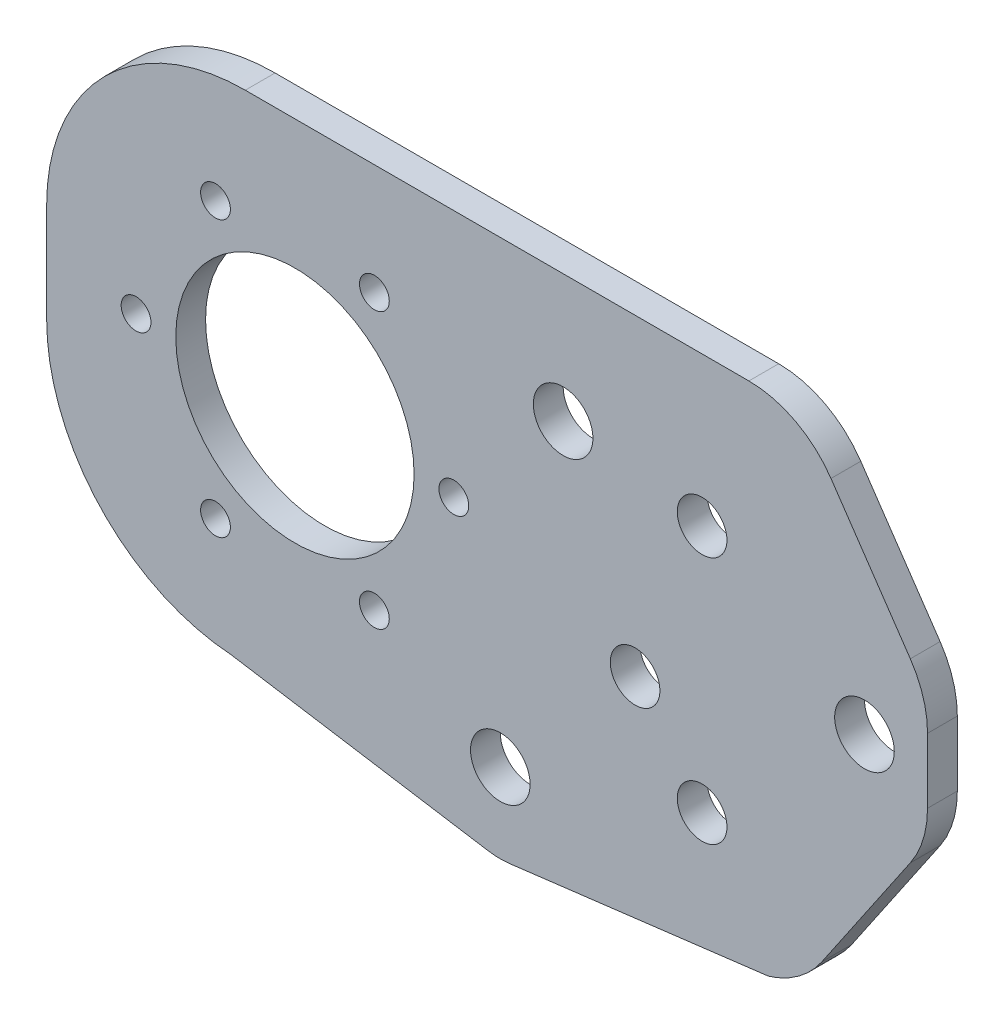
ISO-10303-21;
HEADER;
FILE_DESCRIPTION(('STEP AP214'),'2;1');
FILE_NAME('part.step','',(''),(''),'','','');
FILE_SCHEMA(('AUTOMOTIVE_DESIGN { 1 0 10303 214 1 1 1 1 }'));
ENDSEC;
DATA;
#1=APPLICATION_CONTEXT('core data for automotive mechanical design processes');
#2=APPLICATION_PROTOCOL_DEFINITION('international standard','automotive_design',2000,#1);
#3=PRODUCT_CONTEXT('',#1,'mechanical');
#4=PRODUCT('Part','Part','',(#3));
#5=PRODUCT_RELATED_PRODUCT_CATEGORY('part','',(#4));
#6=PRODUCT_DEFINITION_FORMATION('','',#4);
#7=PRODUCT_DEFINITION_CONTEXT('part definition',#1,'design');
#8=PRODUCT_DEFINITION('design','',#6,#7);
#9=PRODUCT_DEFINITION_SHAPE('','',#8);
#10=(LENGTH_UNIT() NAMED_UNIT(*) SI_UNIT(.MILLI.,.METRE.));
#11=(NAMED_UNIT(*) PLANE_ANGLE_UNIT() SI_UNIT($,.RADIAN.));
#12=(NAMED_UNIT(*) SI_UNIT($,.STERADIAN.) SOLID_ANGLE_UNIT());
#13=UNCERTAINTY_MEASURE_WITH_UNIT(LENGTH_MEASURE(1.E-05),#10,'distance_accuracy_value','');
#14=(GEOMETRIC_REPRESENTATION_CONTEXT(3) GLOBAL_UNCERTAINTY_ASSIGNED_CONTEXT((#13)) GLOBAL_UNIT_ASSIGNED_CONTEXT((#10,
#11,#12)) REPRESENTATION_CONTEXT('',''));
#15=CARTESIAN_POINT('',(0.,0.,0.));
#16=DIRECTION('',(0.,0.,1.));
#17=DIRECTION('',(1.,0.,0.));
#18=AXIS2_PLACEMENT_3D('',#15,#16,#17);
#19=CARTESIAN_POINT('',(0.,0.,3.));
#20=DIRECTION('',(0.,0.,-1.));
#21=DIRECTION('',(-1.,0.,0.));
#22=AXIS2_PLACEMENT_3D('',#19,#20,#21);
#23=PLANE('',#22);
#24=CARTESIAN_POINT('',(66.,35.,3.));
#25=DIRECTION('',(0.,0.,1.));
#26=DIRECTION('',(1.,0.,0.));
#27=AXIS2_PLACEMENT_3D('',#24,#25,#26);
#28=CIRCLE('',#27,2.5);
#29=CARTESIAN_POINT('',(68.5,35.,3.));
#30=VERTEX_POINT('',#29);
#31=EDGE_CURVE('E315',#30,#30,#28,.T.);
#32=ORIENTED_EDGE('',*,*,#31,.F.);
#33=EDGE_LOOP('',(#32));
#34=FACE_BOUND('',#33,.T.);
#35=CARTESIAN_POINT('',(66.,10.,3.));
#36=DIRECTION('',(0.,0.,1.));
#37=DIRECTION('',(1.,0.,0.));
#38=AXIS2_PLACEMENT_3D('',#35,#36,#37);
#39=CIRCLE('',#38,2.5);
#40=CARTESIAN_POINT('',(68.5,10.,3.));
#41=VERTEX_POINT('',#40);
#42=EDGE_CURVE('E321',#41,#41,#39,.T.);
#43=ORIENTED_EDGE('',*,*,#42,.F.);
#44=EDGE_LOOP('',(#43));
#45=FACE_BOUND('',#44,.T.);
#46=DIRECTION('',(-0.562855404948393,-0.826555378132876,0.));
#47=VECTOR('',#46,1.);
#48=CARTESIAN_POINT('',(51.9227282771489,-35.3575683174151,3.));
#49=LINE('',#48,#47);
#50=CARTESIAN_POINT('',(86.9655537813288,16.1029588993529,3.));
#51=VERTEX_POINT('',#50);
#52=CARTESIAN_POINT('',(78.0602989437009,3.02555711023785,3.));
#53=VERTEX_POINT('',#52);
#54=EDGE_CURVE('E340',#51,#53,#49,.T.);
#55=ORIENTED_EDGE('',*,*,#54,.F.);
#56=CARTESIAN_POINT('',(78.7,21.7315129488368,3.));
#57=DIRECTION('',(0.,0.,-1.));
#58=DIRECTION('',(-1.,0.,0.));
#59=AXIS2_PLACEMENT_3D('',#56,#57,#58);
#60=CIRCLE('',#59,10.);
#61=CARTESIAN_POINT('',(88.7,21.7315129488368,3.));
#62=VERTEX_POINT('',#61);
#63=EDGE_CURVE('E297',#51,#62,#60,.F.);
#64=ORIENTED_EDGE('',*,*,#63,.T.);
#65=DIRECTION('',(0.,-1.,0.));
#66=VECTOR('',#65,1.);
#67=CARTESIAN_POINT('',(88.7,0.,3.));
#68=LINE('',#67,#66);
#69=CARTESIAN_POINT('',(88.7,28.2684870511632,3.));
#70=VERTEX_POINT('',#69);
#71=EDGE_CURVE('E342',#70,#62,#68,.T.);
#72=ORIENTED_EDGE('',*,*,#71,.F.);
#73=CARTESIAN_POINT('',(78.7,28.2684870511632,3.));
#74=DIRECTION('',(0.,0.,-1.));
#75=DIRECTION('',(-1.,0.,0.));
#76=AXIS2_PLACEMENT_3D('',#73,#74,#75);
#77=CIRCLE('',#76,10.);
#78=CARTESIAN_POINT('',(86.9655537813288,33.8970411006471,3.));
#79=VERTEX_POINT('',#78);
#80=EDGE_CURVE('E295',#70,#79,#77,.F.);
#81=ORIENTED_EDGE('',*,*,#80,.T.);
#82=DIRECTION('',(0.562855404948393,-0.826555378132876,0.));
#83=VECTOR('',#82,1.);
#84=CARTESIAN_POINT('',(75.1842863807115,51.1978786613961,3.));
#85=LINE('',#84,#83);
#86=CARTESIAN_POINT('',(78.9768023362764,45.6285540494839,3.));
#87=VERTEX_POINT('',#86);
#88=EDGE_CURVE('E180',#87,#79,#85,.T.);
#89=ORIENTED_EDGE('',*,*,#88,.F.);
#90=CARTESIAN_POINT('',(70.7112485549476,40.,3.));
#91=DIRECTION('',(0.,0.,-1.));
#92=DIRECTION('',(-1.,0.,0.));
#93=AXIS2_PLACEMENT_3D('',#90,#91,#92);
#94=CIRCLE('',#93,10.);
#95=CARTESIAN_POINT('',(70.7112485549476,50.,3.));
#96=VERTEX_POINT('',#95);
#97=EDGE_CURVE('E293',#87,#96,#94,.F.);
#98=ORIENTED_EDGE('',*,*,#97,.T.);
#99=DIRECTION('',(-1.,0.,0.));
#100=VECTOR('',#99,1.);
#101=CARTESIAN_POINT('',(0.,50.,3.));
#102=LINE('',#101,#100);
#103=CARTESIAN_POINT('',(20.,50.,3.));
#104=VERTEX_POINT('',#103);
#105=EDGE_CURVE('E262',#96,#104,#102,.T.);
#106=ORIENTED_EDGE('',*,*,#105,.T.);
#107=CARTESIAN_POINT('',(20.,30.,3.));
#108=DIRECTION('',(0.,0.,-1.));
#109=DIRECTION('',(-1.,0.,0.));
#110=AXIS2_PLACEMENT_3D('',#107,#108,#109);
#111=CIRCLE('',#110,20.);
#112=CARTESIAN_POINT('',(0.,30.,3.));
#113=VERTEX_POINT('',#112);
#114=EDGE_CURVE('E278',#104,#113,#111,.F.);
#115=ORIENTED_EDGE('',*,*,#114,.T.);
#116=DIRECTION('',(0.,-1.,0.));
#117=VECTOR('',#116,1.);
#118=CARTESIAN_POINT('',(0.,0.,3.));
#119=LINE('',#118,#117);
#120=CARTESIAN_POINT('',(0.,20.,3.));
#121=VERTEX_POINT('',#120);
#122=EDGE_CURVE('E259',#113,#121,#119,.T.);
#123=ORIENTED_EDGE('',*,*,#122,.T.);
#124=CARTESIAN_POINT('',(20.,20.,3.));
#125=DIRECTION('',(0.,0.,-1.));
#126=DIRECTION('',(-1.,0.,0.));
#127=AXIS2_PLACEMENT_3D('',#124,#125,#126);
#128=CIRCLE('',#127,20.);
#129=CARTESIAN_POINT('',(18.6055579940404,0.0486709341955,3.));
#130=VERTEX_POINT('',#129);
#131=EDGE_CURVE('E280',#121,#130,#128,.F.);
#132=ORIENTED_EDGE('',*,*,#131,.T.);
#133=DIRECTION('',(-0.987366406521585,0.158453713344474,0.));
#134=VECTOR('',#133,1.);
#135=CARTESIAN_POINT('',(0.474755181089373,2.95832333137346,3.));
#136=LINE('',#135,#134);
#137=CARTESIAN_POINT('',(44.4128923847144,-4.092920210404,3.));
#138=VERTEX_POINT('',#137);
#139=EDGE_CURVE('E170',#138,#130,#136,.T.);
#140=ORIENTED_EDGE('',*,*,#139,.F.);
#141=CARTESIAN_POINT('',(45.6807315621777,3.80731630836905,3.));
#142=DIRECTION('',(0.,0.,-1.));
#143=DIRECTION('',(-1.,0.,0.));
#144=AXIS2_PLACEMENT_3D('',#141,#142,#143);
#145=CIRCLE('',#144,8.00132196780421);
#146=CARTESIAN_POINT('',(46.6605722584746,-4.13378345440602,3.));
#147=VERTEX_POINT('',#146);
#148=EDGE_CURVE('E151',#147,#138,#145,.T.);
#149=ORIENTED_EDGE('',*,*,#148,.F.);
#150=DIRECTION('',(-0.992473468100465,-0.122459851039575,0.));
#151=VECTOR('',#150,1.);
#152=CARTESIAN_POINT('',(1.20215371738415,-9.74283129494042,3.));
#153=LINE('',#152,#151);
#154=CARTESIAN_POINT('',(72.6649046399083,-0.925146879053661,3.));
#155=VERTEX_POINT('',#154);
#156=EDGE_CURVE('E167',#155,#147,#153,.T.);
#157=ORIENTED_EDGE('',*,*,#156,.F.);
#158=CARTESIAN_POINT('',(69.7947451623843,8.65411115972884,3.));
#159=DIRECTION('',(0.,0.,-1.));
#160=DIRECTION('',(-1.,0.,0.));
#161=AXIS2_PLACEMENT_3D('',#158,#159,#160);
#162=CIRCLE('',#161,10.);
#163=CARTESIAN_POINT('',(74.805369877433,0.,3.));
#164=VERTEX_POINT('',#163);
#165=EDGE_CURVE('E159',#164,#155,#162,.T.);
#166=ORIENTED_EDGE('',*,*,#165,.F.);
#167=CARTESIAN_POINT('',(69.7947451623721,8.65411115972178,3.));
#168=DIRECTION('',(0.,0.,-1.));
#169=DIRECTION('',(-1.,0.,0.));
#170=AXIS2_PLACEMENT_3D('',#167,#168,#169);
#171=CIRCLE('',#170,10.);
#172=EDGE_CURVE('E291',#164,#53,#171,.F.);
#173=ORIENTED_EDGE('',*,*,#172,.T.);
#174=EDGE_LOOP('',(#55,#64,#72,#81,#89,#98,#106,#115,#123,#132,#140,#149,#157,#166,#173));
#175=FACE_BOUND('',#174,.T.);
#176=CARTESIAN_POINT('',(45.6807315621777,3.80731630836905,3.));
#177=DIRECTION('',(0.,0.,-1.));
#178=DIRECTION('',(-1.,0.,0.));
#179=AXIS2_PLACEMENT_3D('',#176,#177,#178);
#180=CIRCLE('',#179,3.);
#181=CARTESIAN_POINT('',(42.6807315621776,3.80731630836905,3.));
#182=VERTEX_POINT('',#181);
#183=EDGE_CURVE('E199',#182,#182,#180,.T.);
#184=ORIENTED_EDGE('',*,*,#183,.T.);
#185=EDGE_LOOP('',(#184));
#186=FACE_BOUND('',#185,.T.);
#187=CARTESIAN_POINT('',(52.0071048996482,37.14243735581,3.));
#188=DIRECTION('',(0.,0.,-1.));
#189=DIRECTION('',(-1.,0.,0.));
#190=AXIS2_PLACEMENT_3D('',#187,#188,#189);
#191=CIRCLE('',#190,3.);
#192=CARTESIAN_POINT('',(49.0071048996482,37.14243735581,3.));
#193=VERTEX_POINT('',#192);
#194=EDGE_CURVE('E206',#193,#193,#191,.T.);
#195=ORIENTED_EDGE('',*,*,#194,.T.);
#196=EDGE_LOOP('',(#195));
#197=FACE_BOUND('',#196,.T.);
#198=CARTESIAN_POINT('',(25.,25.,3.));
#199=DIRECTION('',(0.,0.,1.));
#200=DIRECTION('',(1.,0.,0.));
#201=AXIS2_PLACEMENT_3D('',#198,#199,#200);
#202=CIRCLE('',#201,12.);
#203=CARTESIAN_POINT('',(37.,25.,3.));
#204=VERTEX_POINT('',#203);
#205=EDGE_CURVE('E253',#204,#204,#202,.T.);
#206=ORIENTED_EDGE('',*,*,#205,.F.);
#207=EDGE_LOOP('',(#206));
#208=FACE_BOUND('',#207,.T.);
#209=CARTESIAN_POINT('',(59.25,18.5,3.));
#210=DIRECTION('',(0.,0.,1.));
#211=DIRECTION('',(1.,0.,0.));
#212=AXIS2_PLACEMENT_3D('',#209,#210,#211);
#213=CIRCLE('',#212,2.5);
#214=CARTESIAN_POINT('',(61.75,18.5,3.));
#215=VERTEX_POINT('',#214);
#216=EDGE_CURVE('E247',#215,#215,#213,.T.);
#217=ORIENTED_EDGE('',*,*,#216,.F.);
#218=EDGE_LOOP('',(#217));
#219=FACE_BOUND('',#218,.T.);
#220=CARTESIAN_POINT('',(17.,38.856406460551,3.));
#221=DIRECTION('',(0.,0.,1.));
#222=DIRECTION('',(1.,0.,0.));
#223=AXIS2_PLACEMENT_3D('',#220,#221,#222);
#224=CIRCLE('',#223,1.5);
#225=CARTESIAN_POINT('',(18.5,38.856406460551,3.));
#226=VERTEX_POINT('',#225);
#227=EDGE_CURVE('E241',#226,#226,#224,.T.);
#228=ORIENTED_EDGE('',*,*,#227,.F.);
#229=EDGE_LOOP('',(#228));
#230=FACE_BOUND('',#229,.T.);
#231=CARTESIAN_POINT('',(33.,38.856406460551,3.));
#232=DIRECTION('',(0.,0.,1.));
#233=DIRECTION('',(1.,0.,0.));
#234=AXIS2_PLACEMENT_3D('',#231,#232,#233);
#235=CIRCLE('',#234,1.5);
#236=CARTESIAN_POINT('',(34.5,38.856406460551,3.));
#237=VERTEX_POINT('',#236);
#238=EDGE_CURVE('E235',#237,#237,#235,.T.);
#239=ORIENTED_EDGE('',*,*,#238,.F.);
#240=EDGE_LOOP('',(#239));
#241=FACE_BOUND('',#240,.T.);
#242=CARTESIAN_POINT('',(41.,25.,3.));
#243=DIRECTION('',(0.,0.,1.));
#244=DIRECTION('',(1.,0.,0.));
#245=AXIS2_PLACEMENT_3D('',#242,#243,#244);
#246=CIRCLE('',#245,1.5);
#247=CARTESIAN_POINT('',(42.5,25.,3.));
#248=VERTEX_POINT('',#247);
#249=EDGE_CURVE('E229',#248,#248,#246,.T.);
#250=ORIENTED_EDGE('',*,*,#249,.F.);
#251=EDGE_LOOP('',(#250));
#252=FACE_BOUND('',#251,.T.);
#253=CARTESIAN_POINT('',(33.,11.143593539449,3.));
#254=DIRECTION('',(0.,0.,1.));
#255=DIRECTION('',(1.,0.,0.));
#256=AXIS2_PLACEMENT_3D('',#253,#254,#255);
#257=CIRCLE('',#256,1.5);
#258=CARTESIAN_POINT('',(34.5,11.143593539449,3.));
#259=VERTEX_POINT('',#258);
#260=EDGE_CURVE('E223',#259,#259,#257,.T.);
#261=ORIENTED_EDGE('',*,*,#260,.F.);
#262=EDGE_LOOP('',(#261));
#263=FACE_BOUND('',#262,.T.);
#264=CARTESIAN_POINT('',(17.,11.143593539449,3.));
#265=DIRECTION('',(0.,0.,1.));
#266=DIRECTION('',(1.,0.,0.));
#267=AXIS2_PLACEMENT_3D('',#264,#265,#266);
#268=CIRCLE('',#267,1.49999999999999);
#269=CARTESIAN_POINT('',(18.5,11.143593539449,3.));
#270=VERTEX_POINT('',#269);
#271=EDGE_CURVE('E217',#270,#270,#268,.T.);
#272=ORIENTED_EDGE('',*,*,#271,.F.);
#273=EDGE_LOOP('',(#272));
#274=FACE_BOUND('',#273,.T.);
#275=CARTESIAN_POINT('',(9.,25.,3.));
#276=DIRECTION('',(0.,0.,1.));
#277=DIRECTION('',(1.,0.,0.));
#278=AXIS2_PLACEMENT_3D('',#275,#276,#277);
#279=CIRCLE('',#278,1.5);
#280=CARTESIAN_POINT('',(10.5,25.,3.));
#281=VERTEX_POINT('',#280);
#282=EDGE_CURVE('E211',#281,#281,#279,.T.);
#283=ORIENTED_EDGE('',*,*,#282,.F.);
#284=EDGE_LOOP('',(#283));
#285=FACE_BOUND('',#284,.T.);
#286=CARTESIAN_POINT('',(82.35,25.,3.));
#287=DIRECTION('',(0.,0.,1.));
#288=DIRECTION('',(1.,0.,0.));
#289=AXIS2_PLACEMENT_3D('',#286,#287,#288);
#290=CIRCLE('',#289,3.00000000000001);
#291=CARTESIAN_POINT('',(85.35,25.,3.));
#292=VERTEX_POINT('',#291);
#293=EDGE_CURVE('E319',#292,#292,#290,.T.);
#294=ORIENTED_EDGE('',*,*,#293,.F.);
#295=EDGE_LOOP('',(#294));
#296=FACE_BOUND('',#295,.T.);
#297=ADVANCED_FACE('F39',(#34,#45,#175,#186,#197,#208,#219,#230,#241,#252,#263,#274,#285,#296),
#23,.F.);
#298=CARTESIAN_POINT('',(0.,0.,0.));
#299=DIRECTION('',(0.,0.,-1.));
#300=DIRECTION('',(-1.,0.,0.));
#301=AXIS2_PLACEMENT_3D('',#298,#299,#300);
#302=PLANE('',#301);
#303=CARTESIAN_POINT('',(66.,35.,0.));
#304=DIRECTION('',(0.,0.,-1.));
#305=DIRECTION('',(-1.,0.,0.));
#306=AXIS2_PLACEMENT_3D('',#303,#304,#305);
#307=CIRCLE('',#306,2.5);
#308=CARTESIAN_POINT('',(63.5,35.,0.));
#309=VERTEX_POINT('',#308);
#310=EDGE_CURVE('E43',#309,#309,#307,.T.);
#311=ORIENTED_EDGE('',*,*,#310,.F.);
#312=EDGE_LOOP('',(#311));
#313=FACE_BOUND('',#312,.T.);
#314=CARTESIAN_POINT('',(66.,10.,0.));
#315=DIRECTION('',(0.,0.,-1.));
#316=DIRECTION('',(-1.,0.,0.));
#317=AXIS2_PLACEMENT_3D('',#314,#315,#316);
#318=CIRCLE('',#317,2.5);
#319=CARTESIAN_POINT('',(63.5,10.,0.));
#320=VERTEX_POINT('',#319);
#321=EDGE_CURVE('E313',#320,#320,#318,.T.);
#322=ORIENTED_EDGE('',*,*,#321,.F.);
#323=EDGE_LOOP('',(#322));
#324=FACE_BOUND('',#323,.T.);
#325=DIRECTION('',(0.,-1.,0.));
#326=VECTOR('',#325,1.);
#327=CARTESIAN_POINT('',(88.7,0.,0.));
#328=LINE('',#327,#326);
#329=CARTESIAN_POINT('',(88.7,28.2684870511632,0.));
#330=VERTEX_POINT('',#329);
#331=CARTESIAN_POINT('',(88.7,21.7315129488368,0.));
#332=VERTEX_POINT('',#331);
#333=EDGE_CURVE('E334',#330,#332,#328,.T.);
#334=ORIENTED_EDGE('',*,*,#333,.T.);
#335=CARTESIAN_POINT('',(78.7,21.7315129488368,0.));
#336=DIRECTION('',(0.,0.,-1.));
#337=DIRECTION('',(-1.,0.,0.));
#338=AXIS2_PLACEMENT_3D('',#335,#336,#337);
#339=CIRCLE('',#338,10.);
#340=CARTESIAN_POINT('',(86.9655537813288,16.1029588993529,0.));
#341=VERTEX_POINT('',#340);
#342=EDGE_CURVE('E309',#332,#341,#339,.T.);
#343=ORIENTED_EDGE('',*,*,#342,.T.);
#344=DIRECTION('',(-0.562855404948393,-0.826555378132876,0.));
#345=VECTOR('',#344,1.);
#346=CARTESIAN_POINT('',(51.9227282771489,-35.3575683174151,0.));
#347=LINE('',#346,#345);
#348=CARTESIAN_POINT('',(78.0602989437009,3.02555711023785,0.));
#349=VERTEX_POINT('',#348);
#350=EDGE_CURVE('E331',#341,#349,#347,.T.);
#351=ORIENTED_EDGE('',*,*,#350,.T.);
#352=CARTESIAN_POINT('',(69.7947451623721,8.65411115972178,0.));
#353=DIRECTION('',(0.,0.,-1.));
#354=DIRECTION('',(-1.,0.,0.));
#355=AXIS2_PLACEMENT_3D('',#352,#353,#354);
#356=CIRCLE('',#355,10.);
#357=CARTESIAN_POINT('',(74.805369877433,0.,0.));
#358=VERTEX_POINT('',#357);
#359=EDGE_CURVE('E304',#349,#358,#356,.T.);
#360=ORIENTED_EDGE('',*,*,#359,.T.);
#361=CARTESIAN_POINT('',(69.7947451623843,8.65411115972884,0.));
#362=DIRECTION('',(0.,0.,-1.));
#363=DIRECTION('',(-1.,0.,0.));
#364=AXIS2_PLACEMENT_3D('',#361,#362,#363);
#365=CIRCLE('',#364,10.);
#366=CARTESIAN_POINT('',(72.6649046399083,-0.925146879053661,0.));
#367=VERTEX_POINT('',#366);
#368=EDGE_CURVE('E174',#358,#367,#365,.T.);
#369=ORIENTED_EDGE('',*,*,#368,.T.);
#370=DIRECTION('',(-0.992473468100465,-0.122459851039575,0.));
#371=VECTOR('',#370,1.);
#372=CARTESIAN_POINT('',(1.20215371738415,-9.74283129494042,0.));
#373=LINE('',#372,#371);
#374=CARTESIAN_POINT('',(46.6605722584746,-4.13378345440602,0.));
#375=VERTEX_POINT('',#374);
#376=EDGE_CURVE('E185',#367,#375,#373,.T.);
#377=ORIENTED_EDGE('',*,*,#376,.T.);
#378=CARTESIAN_POINT('',(45.6807315621777,3.80731630836905,0.));
#379=DIRECTION('',(0.,0.,-1.));
#380=DIRECTION('',(-1.,0.,0.));
#381=AXIS2_PLACEMENT_3D('',#378,#379,#380);
#382=CIRCLE('',#381,8.00132196780421);
#383=CARTESIAN_POINT('',(44.4128923847144,-4.092920210404,0.));
#384=VERTEX_POINT('',#383);
#385=EDGE_CURVE('E153',#375,#384,#382,.T.);
#386=ORIENTED_EDGE('',*,*,#385,.T.);
#387=DIRECTION('',(-0.987366406521585,0.158453713344474,0.));
#388=VECTOR('',#387,1.);
#389=CARTESIAN_POINT('',(0.474755181089373,2.95832333137346,0.));
#390=LINE('',#389,#388);
#391=CARTESIAN_POINT('',(18.6055579940404,0.0486709341955063,0.));
#392=VERTEX_POINT('',#391);
#393=EDGE_CURVE('E177',#384,#392,#390,.T.);
#394=ORIENTED_EDGE('',*,*,#393,.T.);
#395=CARTESIAN_POINT('',(20.,20.,0.));
#396=DIRECTION('',(0.,0.,-1.));
#397=DIRECTION('',(-1.,0.,0.));
#398=AXIS2_PLACEMENT_3D('',#395,#396,#397);
#399=CIRCLE('',#398,20.);
#400=CARTESIAN_POINT('',(0.,20.,0.));
#401=VERTEX_POINT('',#400);
#402=EDGE_CURVE('E271',#392,#401,#399,.T.);
#403=ORIENTED_EDGE('',*,*,#402,.T.);
#404=DIRECTION('',(0.,-1.,0.));
#405=VECTOR('',#404,1.);
#406=CARTESIAN_POINT('',(0.,0.,0.));
#407=LINE('',#406,#405);
#408=CARTESIAN_POINT('',(0.,30.,0.));
#409=VERTEX_POINT('',#408);
#410=EDGE_CURVE('E256',#409,#401,#407,.T.);
#411=ORIENTED_EDGE('',*,*,#410,.F.);
#412=CARTESIAN_POINT('',(20.,30.,0.));
#413=DIRECTION('',(0.,0.,-1.));
#414=DIRECTION('',(-1.,0.,0.));
#415=AXIS2_PLACEMENT_3D('',#412,#413,#414);
#416=CIRCLE('',#415,20.);
#417=CARTESIAN_POINT('',(20.,50.,0.));
#418=VERTEX_POINT('',#417);
#419=EDGE_CURVE('E265',#409,#418,#416,.T.);
#420=ORIENTED_EDGE('',*,*,#419,.T.);
#421=DIRECTION('',(-1.,0.,0.));
#422=VECTOR('',#421,1.);
#423=CARTESIAN_POINT('',(0.,50.,0.));
#424=LINE('',#423,#422);
#425=CARTESIAN_POINT('',(70.7112485549476,50.,0.));
#426=VERTEX_POINT('',#425);
#427=EDGE_CURVE('E263',#426,#418,#424,.T.);
#428=ORIENTED_EDGE('',*,*,#427,.F.);
#429=CARTESIAN_POINT('',(70.7112485549476,40.,0.));
#430=DIRECTION('',(0.,0.,-1.));
#431=DIRECTION('',(-1.,0.,0.));
#432=AXIS2_PLACEMENT_3D('',#429,#430,#431);
#433=CIRCLE('',#432,10.);
#434=CARTESIAN_POINT('',(78.9768023362764,45.6285540494839,0.));
#435=VERTEX_POINT('',#434);
#436=EDGE_CURVE('E62',#426,#435,#433,.T.);
#437=ORIENTED_EDGE('',*,*,#436,.T.);
#438=DIRECTION('',(0.562855404948393,-0.826555378132876,0.));
#439=VECTOR('',#438,1.);
#440=CARTESIAN_POINT('',(75.1842863807115,51.1978786613961,0.));
#441=LINE('',#440,#439);
#442=CARTESIAN_POINT('',(86.9655537813288,33.8970411006471,0.));
#443=VERTEX_POINT('',#442);
#444=EDGE_CURVE('E187',#435,#443,#441,.T.);
#445=ORIENTED_EDGE('',*,*,#444,.T.);
#446=CARTESIAN_POINT('',(78.7,28.2684870511632,0.));
#447=DIRECTION('',(0.,0.,-1.));
#448=DIRECTION('',(-1.,0.,0.));
#449=AXIS2_PLACEMENT_3D('',#446,#447,#448);
#450=CIRCLE('',#449,10.);
#451=EDGE_CURVE('E307',#443,#330,#450,.T.);
#452=ORIENTED_EDGE('',*,*,#451,.T.);
#453=EDGE_LOOP('',(#334,#343,#351,#360,#369,#377,#386,#394,#403,#411,#420,#428,#437,#445,#452));
#454=FACE_BOUND('',#453,.T.);
#455=CARTESIAN_POINT('',(45.6807315621777,3.80731630836905,0.));
#456=DIRECTION('',(0.,0.,-1.));
#457=DIRECTION('',(-1.,0.,0.));
#458=AXIS2_PLACEMENT_3D('',#455,#456,#457);
#459=CIRCLE('',#458,3.);
#460=CARTESIAN_POINT('',(42.6807315621776,3.80731630836905,0.));
#461=VERTEX_POINT('',#460);
#462=EDGE_CURVE('E203',#461,#461,#459,.T.);
#463=ORIENTED_EDGE('',*,*,#462,.F.);
#464=EDGE_LOOP('',(#463));
#465=FACE_BOUND('',#464,.T.);
#466=CARTESIAN_POINT('',(52.0071048996482,37.14243735581,0.));
#467=DIRECTION('',(0.,0.,-1.));
#468=DIRECTION('',(-1.,0.,0.));
#469=AXIS2_PLACEMENT_3D('',#466,#467,#468);
#470=CIRCLE('',#469,3.);
#471=CARTESIAN_POINT('',(49.0071048996482,37.14243735581,0.));
#472=VERTEX_POINT('',#471);
#473=EDGE_CURVE('E191',#472,#472,#470,.T.);
#474=ORIENTED_EDGE('',*,*,#473,.F.);
#475=EDGE_LOOP('',(#474));
#476=FACE_BOUND('',#475,.T.);
#477=CARTESIAN_POINT('',(17.,11.143593539449,0.));
#478=DIRECTION('',(0.,0.,1.));
#479=DIRECTION('',(1.,0.,0.));
#480=AXIS2_PLACEMENT_3D('',#477,#478,#479);
#481=CIRCLE('',#480,1.49999999999999);
#482=CARTESIAN_POINT('',(18.5,11.143593539449,0.));
#483=VERTEX_POINT('',#482);
#484=EDGE_CURVE('E214',#483,#483,#481,.T.);
#485=ORIENTED_EDGE('',*,*,#484,.T.);
#486=EDGE_LOOP('',(#485));
#487=FACE_BOUND('',#486,.T.);
#488=CARTESIAN_POINT('',(41.,25.,0.));
#489=DIRECTION('',(0.,0.,1.));
#490=DIRECTION('',(1.,0.,0.));
#491=AXIS2_PLACEMENT_3D('',#488,#489,#490);
#492=CIRCLE('',#491,1.5);
#493=CARTESIAN_POINT('',(42.5,25.,0.));
#494=VERTEX_POINT('',#493);
#495=EDGE_CURVE('E226',#494,#494,#492,.T.);
#496=ORIENTED_EDGE('',*,*,#495,.T.);
#497=EDGE_LOOP('',(#496));
#498=FACE_BOUND('',#497,.T.);
#499=CARTESIAN_POINT('',(17.,38.856406460551,0.));
#500=DIRECTION('',(0.,0.,1.));
#501=DIRECTION('',(1.,0.,0.));
#502=AXIS2_PLACEMENT_3D('',#499,#500,#501);
#503=CIRCLE('',#502,1.5);
#504=CARTESIAN_POINT('',(18.5,38.856406460551,0.));
#505=VERTEX_POINT('',#504);
#506=EDGE_CURVE('E238',#505,#505,#503,.T.);
#507=ORIENTED_EDGE('',*,*,#506,.T.);
#508=EDGE_LOOP('',(#507));
#509=FACE_BOUND('',#508,.T.);
#510=CARTESIAN_POINT('',(25.,25.,0.));
#511=DIRECTION('',(0.,0.,1.));
#512=DIRECTION('',(1.,0.,0.));
#513=AXIS2_PLACEMENT_3D('',#510,#511,#512);
#514=CIRCLE('',#513,12.);
#515=CARTESIAN_POINT('',(37.,25.,0.));
#516=VERTEX_POINT('',#515);
#517=EDGE_CURVE('E250',#516,#516,#514,.T.);
#518=ORIENTED_EDGE('',*,*,#517,.T.);
#519=EDGE_LOOP('',(#518));
#520=FACE_BOUND('',#519,.T.);
#521=CARTESIAN_POINT('',(59.25,18.5,0.));
#522=DIRECTION('',(0.,0.,1.));
#523=DIRECTION('',(1.,0.,0.));
#524=AXIS2_PLACEMENT_3D('',#521,#522,#523);
#525=CIRCLE('',#524,2.5);
#526=CARTESIAN_POINT('',(61.75,18.5,0.));
#527=VERTEX_POINT('',#526);
#528=EDGE_CURVE('E244',#527,#527,#525,.T.);
#529=ORIENTED_EDGE('',*,*,#528,.T.);
#530=EDGE_LOOP('',(#529));
#531=FACE_BOUND('',#530,.T.);
#532=CARTESIAN_POINT('',(33.,38.856406460551,0.));
#533=DIRECTION('',(0.,0.,1.));
#534=DIRECTION('',(1.,0.,0.));
#535=AXIS2_PLACEMENT_3D('',#532,#533,#534);
#536=CIRCLE('',#535,1.5);
#537=CARTESIAN_POINT('',(34.5,38.856406460551,0.));
#538=VERTEX_POINT('',#537);
#539=EDGE_CURVE('E232',#538,#538,#536,.T.);
#540=ORIENTED_EDGE('',*,*,#539,.T.);
#541=EDGE_LOOP('',(#540));
#542=FACE_BOUND('',#541,.T.);
#543=CARTESIAN_POINT('',(33.,11.143593539449,0.));
#544=DIRECTION('',(0.,0.,1.));
#545=DIRECTION('',(1.,0.,0.));
#546=AXIS2_PLACEMENT_3D('',#543,#544,#545);
#547=CIRCLE('',#546,1.5);
#548=CARTESIAN_POINT('',(34.5,11.143593539449,0.));
#549=VERTEX_POINT('',#548);
#550=EDGE_CURVE('E220',#549,#549,#547,.T.);
#551=ORIENTED_EDGE('',*,*,#550,.T.);
#552=EDGE_LOOP('',(#551));
#553=FACE_BOUND('',#552,.T.);
#554=CARTESIAN_POINT('',(9.,25.,0.));
#555=DIRECTION('',(0.,0.,1.));
#556=DIRECTION('',(1.,0.,0.));
#557=AXIS2_PLACEMENT_3D('',#554,#555,#556);
#558=CIRCLE('',#557,1.5);
#559=CARTESIAN_POINT('',(10.5,25.,0.));
#560=VERTEX_POINT('',#559);
#561=EDGE_CURVE('E202',#560,#560,#558,.T.);
#562=ORIENTED_EDGE('',*,*,#561,.T.);
#563=EDGE_LOOP('',(#562));
#564=FACE_BOUND('',#563,.T.);
#565=CARTESIAN_POINT('',(82.35,25.,0.));
#566=DIRECTION('',(0.,0.,1.));
#567=DIRECTION('',(1.,0.,0.));
#568=AXIS2_PLACEMENT_3D('',#565,#566,#567);
#569=CIRCLE('',#568,3.00000000000001);
#570=CARTESIAN_POINT('',(85.35,25.,0.));
#571=VERTEX_POINT('',#570);
#572=EDGE_CURVE('E328',#571,#571,#569,.T.);
#573=ORIENTED_EDGE('',*,*,#572,.T.);
#574=EDGE_LOOP('',(#573));
#575=FACE_BOUND('',#574,.T.);
#576=ADVANCED_FACE('F356',(#313,#324,#454,#465,#476,#487,#498,#509,#520,#531,#542,#553,#564,
#575),#302,.T.);
#577=CARTESIAN_POINT('',(0.,0.,3.));
#578=DIRECTION('',(1.,0.,0.));
#579=DIRECTION('',(0.,0.,-1.));
#580=AXIS2_PLACEMENT_3D('',#577,#578,#579);
#581=PLANE('',#580);
#582=ORIENTED_EDGE('',*,*,#410,.T.);
#583=DIRECTION('',(0.,0.,-1.));
#584=VECTOR('',#583,1.);
#585=CARTESIAN_POINT('',(0.,20.,3.));
#586=LINE('',#585,#584);
#587=EDGE_CURVE('E276',#401,#121,#586,.F.);
#588=ORIENTED_EDGE('',*,*,#587,.T.);
#589=ORIENTED_EDGE('',*,*,#122,.F.);
#590=DIRECTION('',(0.,0.,-1.));
#591=VECTOR('',#590,1.);
#592=CARTESIAN_POINT('',(0.,30.,3.));
#593=LINE('',#592,#591);
#594=EDGE_CURVE('E273',#113,#409,#593,.T.);
#595=ORIENTED_EDGE('',*,*,#594,.T.);
#596=EDGE_LOOP('',(#582,#588,#589,#595));
#597=FACE_BOUND('',#596,.T.);
#598=ADVANCED_FACE('F384',(#597),#581,.F.);
#599=CARTESIAN_POINT('',(0.,50.,3.));
#600=DIRECTION('',(0.,-1.,0.));
#601=DIRECTION('',(0.,0.,-1.));
#602=AXIS2_PLACEMENT_3D('',#599,#600,#601);
#603=PLANE('',#602);
#604=ORIENTED_EDGE('',*,*,#105,.F.);
#605=DIRECTION('',(0.,0.,-1.));
#606=VECTOR('',#605,1.);
#607=CARTESIAN_POINT('',(70.7112485549476,50.,3.));
#608=LINE('',#607,#606);
#609=EDGE_CURVE('E11',#96,#426,#608,.T.);
#610=ORIENTED_EDGE('',*,*,#609,.T.);
#611=ORIENTED_EDGE('',*,*,#427,.T.);
#612=DIRECTION('',(0.,0.,-1.));
#613=VECTOR('',#612,1.);
#614=CARTESIAN_POINT('',(20.,50.,3.));
#615=LINE('',#614,#613);
#616=EDGE_CURVE('E282',#418,#104,#615,.F.);
#617=ORIENTED_EDGE('',*,*,#616,.T.);
#618=EDGE_LOOP('',(#604,#610,#611,#617));
#619=FACE_BOUND('',#618,.T.);
#620=ADVANCED_FACE('F392',(#619),#603,.F.);
#621=CARTESIAN_POINT('',(25.,25.,3.));
#622=DIRECTION('',(0.,0.,-1.));
#623=DIRECTION('',(-1.,0.,0.));
#624=AXIS2_PLACEMENT_3D('',#621,#622,#623);
#625=CYLINDRICAL_SURFACE('',#624,12.);
#626=ORIENTED_EDGE('',*,*,#205,.T.);
#627=EDGE_LOOP('',(#626));
#628=FACE_BOUND('',#627,.T.);
#629=ORIENTED_EDGE('',*,*,#517,.F.);
#630=EDGE_LOOP('',(#629));
#631=FACE_BOUND('',#630,.T.);
#632=ADVANCED_FACE('F413',(#628,#631),#625,.F.);
#633=CARTESIAN_POINT('',(59.25,18.5,3.));
#634=DIRECTION('',(0.,0.,-1.));
#635=DIRECTION('',(-1.,0.,0.));
#636=AXIS2_PLACEMENT_3D('',#633,#634,#635);
#637=CYLINDRICAL_SURFACE('',#636,2.5);
#638=ORIENTED_EDGE('',*,*,#216,.T.);
#639=EDGE_LOOP('',(#638));
#640=FACE_BOUND('',#639,.T.);
#641=ORIENTED_EDGE('',*,*,#528,.F.);
#642=EDGE_LOOP('',(#641));
#643=FACE_BOUND('',#642,.T.);
#644=ADVANCED_FACE('F476',(#640,#643),#637,.F.);
#645=CARTESIAN_POINT('',(17.,38.856406460551,3.));
#646=DIRECTION('',(0.,0.,-1.));
#647=DIRECTION('',(-1.,0.,0.));
#648=AXIS2_PLACEMENT_3D('',#645,#646,#647);
#649=CYLINDRICAL_SURFACE('',#648,1.5);
#650=ORIENTED_EDGE('',*,*,#227,.T.);
#651=EDGE_LOOP('',(#650));
#652=FACE_BOUND('',#651,.T.);
#653=ORIENTED_EDGE('',*,*,#506,.F.);
#654=EDGE_LOOP('',(#653));
#655=FACE_BOUND('',#654,.T.);
#656=ADVANCED_FACE('F473',(#652,#655),#649,.F.);
#657=CARTESIAN_POINT('',(33.,38.856406460551,3.));
#658=DIRECTION('',(0.,0.,-1.));
#659=DIRECTION('',(-1.,0.,0.));
#660=AXIS2_PLACEMENT_3D('',#657,#658,#659);
#661=CYLINDRICAL_SURFACE('',#660,1.5);
#662=ORIENTED_EDGE('',*,*,#238,.T.);
#663=EDGE_LOOP('',(#662));
#664=FACE_BOUND('',#663,.T.);
#665=ORIENTED_EDGE('',*,*,#539,.F.);
#666=EDGE_LOOP('',(#665));
#667=FACE_BOUND('',#666,.T.);
#668=ADVANCED_FACE('F469',(#664,#667),#661,.F.);
#669=CARTESIAN_POINT('',(41.,25.,3.));
#670=DIRECTION('',(0.,0.,-1.));
#671=DIRECTION('',(-1.,0.,0.));
#672=AXIS2_PLACEMENT_3D('',#669,#670,#671);
#673=CYLINDRICAL_SURFACE('',#672,1.5);
#674=ORIENTED_EDGE('',*,*,#249,.T.);
#675=EDGE_LOOP('',(#674));
#676=FACE_BOUND('',#675,.T.);
#677=ORIENTED_EDGE('',*,*,#495,.F.);
#678=EDGE_LOOP('',(#677));
#679=FACE_BOUND('',#678,.T.);
#680=ADVANCED_FACE('F465',(#676,#679),#673,.F.);
#681=CARTESIAN_POINT('',(33.,11.143593539449,3.));
#682=DIRECTION('',(0.,0.,-1.));
#683=DIRECTION('',(-1.,0.,0.));
#684=AXIS2_PLACEMENT_3D('',#681,#682,#683);
#685=CYLINDRICAL_SURFACE('',#684,1.5);
#686=ORIENTED_EDGE('',*,*,#260,.T.);
#687=EDGE_LOOP('',(#686));
#688=FACE_BOUND('',#687,.T.);
#689=ORIENTED_EDGE('',*,*,#550,.F.);
#690=EDGE_LOOP('',(#689));
#691=FACE_BOUND('',#690,.T.);
#692=ADVANCED_FACE('F461',(#688,#691),#685,.F.);
#693=CARTESIAN_POINT('',(17.,11.143593539449,3.));
#694=DIRECTION('',(0.,0.,-1.));
#695=DIRECTION('',(-1.,0.,0.));
#696=AXIS2_PLACEMENT_3D('',#693,#694,#695);
#697=CYLINDRICAL_SURFACE('',#696,1.49999999999999);
#698=ORIENTED_EDGE('',*,*,#271,.T.);
#699=EDGE_LOOP('',(#698));
#700=FACE_BOUND('',#699,.T.);
#701=ORIENTED_EDGE('',*,*,#484,.F.);
#702=EDGE_LOOP('',(#701));
#703=FACE_BOUND('',#702,.T.);
#704=ADVANCED_FACE('F457',(#700,#703),#697,.F.);
#705=CARTESIAN_POINT('',(9.,25.,3.));
#706=DIRECTION('',(0.,0.,-1.));
#707=DIRECTION('',(-1.,0.,0.));
#708=AXIS2_PLACEMENT_3D('',#705,#706,#707);
#709=CYLINDRICAL_SURFACE('',#708,1.5);
#710=ORIENTED_EDGE('',*,*,#282,.T.);
#711=EDGE_LOOP('',(#710));
#712=FACE_BOUND('',#711,.T.);
#713=ORIENTED_EDGE('',*,*,#561,.F.);
#714=EDGE_LOOP('',(#713));
#715=FACE_BOUND('',#714,.T.);
#716=ADVANCED_FACE('F422',(#712,#715),#709,.F.);
#717=CARTESIAN_POINT('',(20.,20.,3.));
#718=DIRECTION('',(0.,0.,-1.));
#719=DIRECTION('',(-1.,0.,0.));
#720=AXIS2_PLACEMENT_3D('',#717,#718,#719);
#721=CYLINDRICAL_SURFACE('',#720,20.);
#722=DIRECTION('',(0.,0.,-1.));
#723=VECTOR('',#722,1.);
#724=CARTESIAN_POINT('',(18.6055579940404,0.0486709341955,3.));
#725=LINE('',#724,#723);
#726=EDGE_CURVE('E195',#130,#392,#725,.T.);
#727=ORIENTED_EDGE('',*,*,#726,.F.);
#728=ORIENTED_EDGE('',*,*,#131,.F.);
#729=ORIENTED_EDGE('',*,*,#587,.F.);
#730=ORIENTED_EDGE('',*,*,#402,.F.);
#731=EDGE_LOOP('',(#727,#728,#729,#730));
#732=FACE_BOUND('',#731,.T.);
#733=ADVANCED_FACE('F381',(#732),#721,.T.);
#734=CARTESIAN_POINT('',(20.,30.,3.));
#735=DIRECTION('',(0.,0.,-1.));
#736=DIRECTION('',(-1.,0.,0.));
#737=AXIS2_PLACEMENT_3D('',#734,#735,#736);
#738=CYLINDRICAL_SURFACE('',#737,20.);
#739=ORIENTED_EDGE('',*,*,#114,.F.);
#740=ORIENTED_EDGE('',*,*,#616,.F.);
#741=ORIENTED_EDGE('',*,*,#419,.F.);
#742=ORIENTED_EDGE('',*,*,#594,.F.);
#743=EDGE_LOOP('',(#739,#740,#741,#742));
#744=FACE_BOUND('',#743,.T.);
#745=ADVANCED_FACE('F390',(#744),#738,.T.);
#746=CARTESIAN_POINT('',(52.0071048996482,37.14243735581,3.));
#747=DIRECTION('',(0.,0.,-1.));
#748=DIRECTION('',(-1.,0.,0.));
#749=AXIS2_PLACEMENT_3D('',#746,#747,#748);
#750=CYLINDRICAL_SURFACE('',#749,3.);
#751=ORIENTED_EDGE('',*,*,#194,.F.);
#752=EDGE_LOOP('',(#751));
#753=FACE_BOUND('',#752,.T.);
#754=ORIENTED_EDGE('',*,*,#473,.T.);
#755=EDGE_LOOP('',(#754));
#756=FACE_BOUND('',#755,.T.);
#757=ADVANCED_FACE('F425',(#753,#756),#750,.F.);
#758=CARTESIAN_POINT('',(45.6807315621777,3.80731630836905,3.));
#759=DIRECTION('',(0.,0.,-1.));
#760=DIRECTION('',(-1.,0.,0.));
#761=AXIS2_PLACEMENT_3D('',#758,#759,#760);
#762=CYLINDRICAL_SURFACE('',#761,3.);
#763=ORIENTED_EDGE('',*,*,#183,.F.);
#764=EDGE_LOOP('',(#763));
#765=FACE_BOUND('',#764,.T.);
#766=ORIENTED_EDGE('',*,*,#462,.T.);
#767=EDGE_LOOP('',(#766));
#768=FACE_BOUND('',#767,.T.);
#769=ADVANCED_FACE('F448',(#765,#768),#762,.F.);
#770=CARTESIAN_POINT('',(1.20215371738415,-9.74283129494042,3.));
#771=DIRECTION('',(0.122459851039575,-0.992473468100465,0.));
#772=DIRECTION('',(0.992473468100465,0.122459851039575,0.));
#773=AXIS2_PLACEMENT_3D('',#770,#771,#772);
#774=PLANE('',#773);
#775=ORIENTED_EDGE('',*,*,#376,.F.);
#776=DIRECTION('',(0.,0.,-1.));
#777=VECTOR('',#776,1.);
#778=CARTESIAN_POINT('',(72.6649046399083,-0.925146879053661,3.));
#779=LINE('',#778,#777);
#780=EDGE_CURVE('E173',#155,#367,#779,.T.);
#781=ORIENTED_EDGE('',*,*,#780,.F.);
#782=ORIENTED_EDGE('',*,*,#156,.T.);
#783=DIRECTION('',(0.,0.,-1.));
#784=VECTOR('',#783,1.);
#785=CARTESIAN_POINT('',(46.6605722584746,-4.13378345440602,3.));
#786=LINE('',#785,#784);
#787=EDGE_CURVE('E148',#147,#375,#786,.T.);
#788=ORIENTED_EDGE('',*,*,#787,.T.);
#789=EDGE_LOOP('',(#775,#781,#782,#788));
#790=FACE_BOUND('',#789,.T.);
#791=ADVANCED_FACE('F172',(#790),#774,.T.);
#792=CARTESIAN_POINT('',(69.7947451623843,8.65411115972884,3.));
#793=DIRECTION('',(0.,0.,-1.));
#794=DIRECTION('',(-1.,0.,0.));
#795=AXIS2_PLACEMENT_3D('',#792,#793,#794);
#796=CYLINDRICAL_SURFACE('',#795,10.);
#797=ORIENTED_EDGE('',*,*,#368,.F.);
#798=DIRECTION('',(0.,0.,-1.));
#799=VECTOR('',#798,1.);
#800=CARTESIAN_POINT('',(74.805369877433,0.,3.));
#801=LINE('',#800,#799);
#802=EDGE_CURVE('E192',#164,#358,#801,.T.);
#803=ORIENTED_EDGE('',*,*,#802,.F.);
#804=ORIENTED_EDGE('',*,*,#165,.T.);
#805=ORIENTED_EDGE('',*,*,#780,.T.);
#806=EDGE_LOOP('',(#797,#803,#804,#805));
#807=FACE_BOUND('',#806,.T.);
#808=ADVANCED_FACE('F371',(#807),#796,.T.);
#809=CARTESIAN_POINT('',(0.474755181089373,2.95832333137346,3.));
#810=DIRECTION('',(-0.158453713344474,-0.987366406521585,0.));
#811=DIRECTION('',(0.987366406521585,-0.158453713344474,0.));
#812=AXIS2_PLACEMENT_3D('',#809,#810,#811);
#813=PLANE('',#812);
#814=ORIENTED_EDGE('',*,*,#393,.F.);
#815=DIRECTION('',(0.,0.,-1.));
#816=VECTOR('',#815,1.);
#817=CARTESIAN_POINT('',(44.4128923847144,-4.092920210404,3.));
#818=LINE('',#817,#816);
#819=EDGE_CURVE('E158',#138,#384,#818,.T.);
#820=ORIENTED_EDGE('',*,*,#819,.F.);
#821=ORIENTED_EDGE('',*,*,#139,.T.);
#822=ORIENTED_EDGE('',*,*,#726,.T.);
#823=EDGE_LOOP('',(#814,#820,#821,#822));
#824=FACE_BOUND('',#823,.T.);
#825=ADVANCED_FACE('F377',(#824),#813,.T.);
#826=CARTESIAN_POINT('',(45.6807315621777,3.80731630836905,3.));
#827=DIRECTION('',(0.,0.,-1.));
#828=DIRECTION('',(-1.,0.,0.));
#829=AXIS2_PLACEMENT_3D('',#826,#827,#828);
#830=CYLINDRICAL_SURFACE('',#829,8.00132196780421);
#831=ORIENTED_EDGE('',*,*,#385,.F.);
#832=ORIENTED_EDGE('',*,*,#787,.F.);
#833=ORIENTED_EDGE('',*,*,#148,.T.);
#834=ORIENTED_EDGE('',*,*,#819,.T.);
#835=EDGE_LOOP('',(#831,#832,#833,#834));
#836=FACE_BOUND('',#835,.T.);
#837=ADVANCED_FACE('F150',(#836),#830,.T.);
#838=CARTESIAN_POINT('',(75.1842863807115,51.1978786613961,0.));
#839=DIRECTION('',(-0.826555378132875,-0.562855404948393,0.));
#840=DIRECTION('',(0.562855404948393,-0.826555378132876,0.));
#841=AXIS2_PLACEMENT_3D('',#838,#839,#840);
#842=PLANE('',#841);
#843=ORIENTED_EDGE('',*,*,#88,.T.);
#844=DIRECTION('',(0.,0.,1.));
#845=VECTOR('',#844,1.);
#846=CARTESIAN_POINT('',(86.9655537813288,33.8970411006472,0.));
#847=LINE('',#846,#845);
#848=EDGE_CURVE('E48',#79,#443,#847,.F.);
#849=ORIENTED_EDGE('',*,*,#848,.T.);
#850=ORIENTED_EDGE('',*,*,#444,.F.);
#851=DIRECTION('',(0.,0.,-1.));
#852=VECTOR('',#851,1.);
#853=CARTESIAN_POINT('',(78.9768023362764,45.6285540494839,0.));
#854=LINE('',#853,#852);
#855=EDGE_CURVE('E311',#435,#87,#854,.F.);
#856=ORIENTED_EDGE('',*,*,#855,.T.);
#857=EDGE_LOOP('',(#843,#849,#850,#856));
#858=FACE_BOUND('',#857,.T.);
#859=ADVANCED_FACE('F348',(#858),#842,.F.);
#860=CARTESIAN_POINT('',(88.7,0.,0.));
#861=DIRECTION('',(-1.,0.,0.));
#862=DIRECTION('',(0.,0.,1.));
#863=AXIS2_PLACEMENT_3D('',#860,#861,#862);
#864=PLANE('',#863);
#865=ORIENTED_EDGE('',*,*,#71,.T.);
#866=DIRECTION('',(0.,0.,1.));
#867=VECTOR('',#866,1.);
#868=CARTESIAN_POINT('',(88.7,21.7315129488368,0.));
#869=LINE('',#868,#867);
#870=EDGE_CURVE('E302',#62,#332,#869,.F.);
#871=ORIENTED_EDGE('',*,*,#870,.T.);
#872=ORIENTED_EDGE('',*,*,#333,.F.);
#873=DIRECTION('',(0.,0.,1.));
#874=VECTOR('',#873,1.);
#875=CARTESIAN_POINT('',(88.7,28.2684870511632,0.));
#876=LINE('',#875,#874);
#877=EDGE_CURVE('E299',#330,#70,#876,.T.);
#878=ORIENTED_EDGE('',*,*,#877,.T.);
#879=EDGE_LOOP('',(#865,#871,#872,#878));
#880=FACE_BOUND('',#879,.T.);
#881=ADVANCED_FACE('F359',(#880),#864,.F.);
#882=CARTESIAN_POINT('',(82.35,25.,0.));
#883=DIRECTION('',(0.,0.,1.));
#884=DIRECTION('',(1.,0.,0.));
#885=AXIS2_PLACEMENT_3D('',#882,#883,#884);
#886=CYLINDRICAL_SURFACE('',#885,3.00000000000001);
#887=ORIENTED_EDGE('',*,*,#572,.F.);
#888=EDGE_LOOP('',(#887));
#889=FACE_BOUND('',#888,.T.);
#890=ORIENTED_EDGE('',*,*,#293,.T.);
#891=EDGE_LOOP('',(#890));
#892=FACE_BOUND('',#891,.T.);
#893=ADVANCED_FACE('F430',(#889,#892),#886,.F.);
#894=CARTESIAN_POINT('',(51.9227282771489,-35.3575683174151,0.));
#895=DIRECTION('',(-0.826555378132875,0.562855404948393,0.));
#896=DIRECTION('',(-0.562855404948393,-0.826555378132876,0.));
#897=AXIS2_PLACEMENT_3D('',#894,#895,#896);
#898=PLANE('',#897);
#899=ORIENTED_EDGE('',*,*,#350,.F.);
#900=DIRECTION('',(0.,0.,1.));
#901=VECTOR('',#900,1.);
#902=CARTESIAN_POINT('',(86.9655537813288,16.1029588993529,0.));
#903=LINE('',#902,#901);
#904=EDGE_CURVE('E288',#341,#51,#903,.T.);
#905=ORIENTED_EDGE('',*,*,#904,.T.);
#906=ORIENTED_EDGE('',*,*,#54,.T.);
#907=DIRECTION('',(0.,0.,-1.));
#908=VECTOR('',#907,1.);
#909=CARTESIAN_POINT('',(78.0602989437008,3.02555711023786,0.));
#910=LINE('',#909,#908);
#911=EDGE_CURVE('E285',#53,#349,#910,.T.);
#912=ORIENTED_EDGE('',*,*,#911,.T.);
#913=EDGE_LOOP('',(#899,#905,#906,#912));
#914=FACE_BOUND('',#913,.T.);
#915=ADVANCED_FACE('F365',(#914),#898,.F.);
#916=CARTESIAN_POINT('',(78.7,21.7315129488368,0.));
#917=DIRECTION('',(0.,0.,1.));
#918=DIRECTION('',(1.,0.,0.));
#919=AXIS2_PLACEMENT_3D('',#916,#917,#918);
#920=CYLINDRICAL_SURFACE('',#919,10.);
#921=ORIENTED_EDGE('',*,*,#342,.F.);
#922=ORIENTED_EDGE('',*,*,#870,.F.);
#923=ORIENTED_EDGE('',*,*,#63,.F.);
#924=ORIENTED_EDGE('',*,*,#904,.F.);
#925=EDGE_LOOP('',(#921,#922,#923,#924));
#926=FACE_BOUND('',#925,.T.);
#927=ADVANCED_FACE('F361',(#926),#920,.T.);
#928=CARTESIAN_POINT('',(78.7,28.2684870511632,0.));
#929=DIRECTION('',(0.,0.,1.));
#930=DIRECTION('',(1.,0.,0.));
#931=AXIS2_PLACEMENT_3D('',#928,#929,#930);
#932=CYLINDRICAL_SURFACE('',#931,10.);
#933=ORIENTED_EDGE('',*,*,#451,.F.);
#934=ORIENTED_EDGE('',*,*,#848,.F.);
#935=ORIENTED_EDGE('',*,*,#80,.F.);
#936=ORIENTED_EDGE('',*,*,#877,.F.);
#937=EDGE_LOOP('',(#933,#934,#935,#936));
#938=FACE_BOUND('',#937,.T.);
#939=ADVANCED_FACE('F353',(#938),#932,.T.);
#940=CARTESIAN_POINT('',(70.7112485549476,40.,3.));
#941=DIRECTION('',(0.,0.,-1.));
#942=DIRECTION('',(-1.,0.,0.));
#943=AXIS2_PLACEMENT_3D('',#940,#941,#942);
#944=CYLINDRICAL_SURFACE('',#943,10.);
#945=ORIENTED_EDGE('',*,*,#97,.F.);
#946=ORIENTED_EDGE('',*,*,#855,.F.);
#947=ORIENTED_EDGE('',*,*,#436,.F.);
#948=ORIENTED_EDGE('',*,*,#609,.F.);
#949=EDGE_LOOP('',(#945,#946,#947,#948));
#950=FACE_BOUND('',#949,.T.);
#951=ADVANCED_FACE('F395',(#950),#944,.T.);
#952=CARTESIAN_POINT('',(69.7947451623721,8.65411115972178,3.));
#953=DIRECTION('',(0.,0.,-1.));
#954=DIRECTION('',(-1.,0.,0.));
#955=AXIS2_PLACEMENT_3D('',#952,#953,#954);
#956=CYLINDRICAL_SURFACE('',#955,10.);
#957=ORIENTED_EDGE('',*,*,#172,.F.);
#958=ORIENTED_EDGE('',*,*,#802,.T.);
#959=ORIENTED_EDGE('',*,*,#359,.F.);
#960=ORIENTED_EDGE('',*,*,#911,.F.);
#961=EDGE_LOOP('',(#957,#958,#959,#960));
#962=FACE_BOUND('',#961,.T.);
#963=ADVANCED_FACE('F41',(#962),#956,.T.);
#964=CARTESIAN_POINT('',(66.,10.,-7.));
#965=DIRECTION('',(0.,0.,1.));
#966=DIRECTION('',(1.,0.,0.));
#967=AXIS2_PLACEMENT_3D('',#964,#965,#966);
#968=CYLINDRICAL_SURFACE('',#967,2.5);
#969=ORIENTED_EDGE('',*,*,#321,.T.);
#970=EDGE_LOOP('',(#969));
#971=FACE_BOUND('',#970,.T.);
#972=ORIENTED_EDGE('',*,*,#42,.T.);
#973=EDGE_LOOP('',(#972));
#974=FACE_BOUND('',#973,.T.);
#975=ADVANCED_FACE('F401',(#971,#974),#968,.F.);
#976=CARTESIAN_POINT('',(66.,35.,-7.));
#977=DIRECTION('',(0.,0.,1.));
#978=DIRECTION('',(1.,0.,0.));
#979=AXIS2_PLACEMENT_3D('',#976,#977,#978);
#980=CYLINDRICAL_SURFACE('',#979,2.5);
#981=ORIENTED_EDGE('',*,*,#310,.T.);
#982=EDGE_LOOP('',(#981));
#983=FACE_BOUND('',#982,.T.);
#984=ORIENTED_EDGE('',*,*,#31,.T.);
#985=EDGE_LOOP('',(#984));
#986=FACE_BOUND('',#985,.T.);
#987=ADVANCED_FACE('F561',(#983,#986),#980,.F.);
#988=CLOSED_SHELL('',(#297,#576,#598,#620,#632,#644,#656,#668,#680,#692,#704,#716,#733,#745,
#757,#769,#791,#808,#825,#837,#859,#881,#893,#915,#927,#939,#951,#963,#975,#987));
#989=MANIFOLD_SOLID_BREP('B2',#988);
#990=ADVANCED_BREP_SHAPE_REPRESENTATION('',(#18,#989),#14);
#991=SHAPE_DEFINITION_REPRESENTATION(#9,#990);
ENDSEC;
END-ISO-10303-21;
